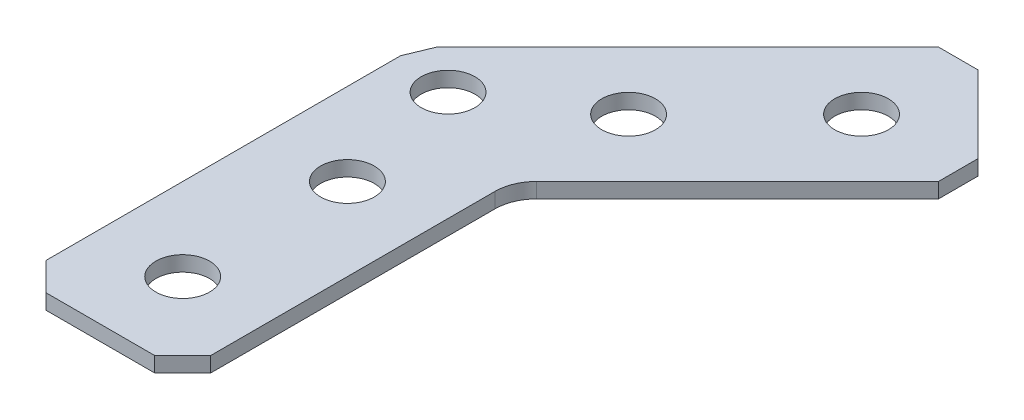
ISO-10303-21;
HEADER;
FILE_DESCRIPTION(('STEP AP214'),'2;1');
FILE_NAME('part.step','',(''),(''),'','','');
FILE_SCHEMA(('AUTOMOTIVE_DESIGN { 1 0 10303 214 1 1 1 1 }'));
ENDSEC;
DATA;
#1=APPLICATION_CONTEXT('core data for automotive mechanical design processes');
#2=APPLICATION_PROTOCOL_DEFINITION('international standard','automotive_design',2000,#1);
#3=PRODUCT_CONTEXT('',#1,'mechanical');
#4=PRODUCT('Part','Part','',(#3));
#5=PRODUCT_RELATED_PRODUCT_CATEGORY('part','',(#4));
#6=PRODUCT_DEFINITION_FORMATION('','',#4);
#7=PRODUCT_DEFINITION_CONTEXT('part definition',#1,'design');
#8=PRODUCT_DEFINITION('design','',#6,#7);
#9=PRODUCT_DEFINITION_SHAPE('','',#8);
#10=(LENGTH_UNIT() NAMED_UNIT(*) SI_UNIT(.MILLI.,.METRE.));
#11=(NAMED_UNIT(*) PLANE_ANGLE_UNIT() SI_UNIT($,.RADIAN.));
#12=(NAMED_UNIT(*) SI_UNIT($,.STERADIAN.) SOLID_ANGLE_UNIT());
#13=UNCERTAINTY_MEASURE_WITH_UNIT(LENGTH_MEASURE(1.E-05),#10,'distance_accuracy_value','');
#14=(GEOMETRIC_REPRESENTATION_CONTEXT(3) GLOBAL_UNCERTAINTY_ASSIGNED_CONTEXT((#13)) GLOBAL_UNIT_ASSIGNED_CONTEXT((#10,
#11,#12)) REPRESENTATION_CONTEXT('',''));
#15=CARTESIAN_POINT('',(0.,0.,0.));
#16=DIRECTION('',(0.,0.,1.));
#17=DIRECTION('',(1.,0.,0.));
#18=AXIS2_PLACEMENT_3D('',#15,#16,#17);
#19=CARTESIAN_POINT('',(-6.34999999999996,1.1684,12.7));
#20=DIRECTION('',(0.,-1.,0.));
#21=DIRECTION('',(0.,0.,-1.));
#22=AXIS2_PLACEMENT_3D('',#19,#20,#21);
#23=PLANE('',#22);
#24=CARTESIAN_POINT('',(15.3302561210692,1.1684,-30.6605122421383));
#25=DIRECTION('',(0.,-1.,0.));
#26=DIRECTION('',(0.,0.,-1.));
#27=AXIS2_PLACEMENT_3D('',#24,#25,#26);
#28=CIRCLE('',#27,2.0701);
#29=CARTESIAN_POINT('',(15.3302561210692,1.1684,-32.7306122421383));
#30=VERTEX_POINT('',#29);
#31=EDGE_CURVE('E226',#30,#30,#28,.T.);
#32=ORIENTED_EDGE('',*,*,#31,.T.);
#33=EDGE_LOOP('',(#32));
#34=FACE_BOUND('',#33,.T.);
#35=CARTESIAN_POINT('',(0.,1.1684,-6.35000000000009));
#36=DIRECTION('',(0.,-1.,0.));
#37=DIRECTION('',(0.,0.,-1.));
#38=AXIS2_PLACEMENT_3D('',#35,#36,#37);
#39=CIRCLE('',#38,2.07009999999998);
#40=CARTESIAN_POINT('',(0.,1.1684,-8.42010000000007));
#41=VERTEX_POINT('',#40);
#42=EDGE_CURVE('E229',#41,#41,#39,.T.);
#43=ORIENTED_EDGE('',*,*,#42,.T.);
#44=EDGE_LOOP('',(#43));
#45=FACE_BOUND('',#44,.T.);
#46=CARTESIAN_POINT('',(-2.08546691384424,1.1684,-16.1940848006638));
#47=DIRECTION('',(0.,-1.,0.));
#48=DIRECTION('',(0.,0.,-1.));
#49=AXIS2_PLACEMENT_3D('',#46,#47,#48);
#50=CIRCLE('',#49,2.0701);
#51=CARTESIAN_POINT('',(-2.08546691384424,1.1684,-18.2641848006638));
#52=VERTEX_POINT('',#51);
#53=EDGE_CURVE('E232',#52,#52,#50,.T.);
#54=ORIENTED_EDGE('',*,*,#53,.T.);
#55=EDGE_LOOP('',(#54));
#56=FACE_BOUND('',#55,.T.);
#57=DIRECTION('',(1.,0.,0.));
#58=VECTOR('',#57,1.);
#59=CARTESIAN_POINT('',(13.8036125804875,1.1684,-38.1141248226257));
#60=LINE('',#59,#58);
#61=CARTESIAN_POINT('',(16.856899661651,1.1684,-38.1141248226257));
#62=VERTEX_POINT('',#61);
#63=CARTESIAN_POINT('',(13.8036125804875,1.1684,-38.1141248226257));
#64=VERTEX_POINT('',#63);
#65=EDGE_CURVE('E165',#62,#64,#60,.F.);
#66=ORIENTED_EDGE('',*,*,#65,.T.);
#67=DIRECTION('',(0.707106781186549,0.,-0.707106781186546));
#68=VECTOR('',#67,1.);
#69=CARTESIAN_POINT('',(-5.52378646952377,1.1684,-18.7867257726145));
#70=LINE('',#69,#68);
#71=CARTESIAN_POINT('',(-5.52378646952377,1.1684,-18.7867257726145));
#72=VERTEX_POINT('',#71);
#73=EDGE_CURVE('E166',#64,#72,#70,.F.);
#74=ORIENTED_EDGE('',*,*,#73,.T.);
#75=DIRECTION('',(0.38268343236509,0.,-0.923879532511287));
#76=VECTOR('',#75,1.);
#77=CARTESIAN_POINT('',(-6.35,1.1684,-16.7920698619227));
#78=LINE('',#77,#76);
#79=CARTESIAN_POINT('',(-6.34999999999999,1.1684,-16.7920698619227));
#80=VERTEX_POINT('',#79);
#81=EDGE_CURVE('E177',#72,#80,#78,.F.);
#82=ORIENTED_EDGE('',*,*,#81,.T.);
#83=DIRECTION('',(0.,0.,-1.));
#84=VECTOR('',#83,1.);
#85=CARTESIAN_POINT('',(-6.34999999999999,1.1684,-12.7));
#86=LINE('',#85,#84);
#87=CARTESIAN_POINT('',(-6.34999999999998,1.1684,10.541));
#88=VERTEX_POINT('',#87);
#89=EDGE_CURVE('E426',#80,#88,#86,.F.);
#90=ORIENTED_EDGE('',*,*,#89,.T.);
#91=DIRECTION('',(-0.707106781186546,0.,-0.707106781186549));
#92=VECTOR('',#91,1.);
#93=CARTESIAN_POINT('',(-4.191,1.1684,12.7));
#94=LINE('',#93,#92);
#95=CARTESIAN_POINT('',(-4.191,1.1684,12.7));
#96=VERTEX_POINT('',#95);
#97=EDGE_CURVE('E428',#88,#96,#94,.F.);
#98=ORIENTED_EDGE('',*,*,#97,.T.);
#99=DIRECTION('',(-1.,0.,0.));
#100=VECTOR('',#99,1.);
#101=CARTESIAN_POINT('',(-6.34999999999999,1.1684,12.7));
#102=LINE('',#101,#100);
#103=CARTESIAN_POINT('',(4.19099999999999,1.1684,12.7));
#104=VERTEX_POINT('',#103);
#105=EDGE_CURVE('E433',#96,#104,#102,.F.);
#106=ORIENTED_EDGE('',*,*,#105,.T.);
#107=DIRECTION('',(-0.707106781186549,0.,0.707106781186546));
#108=VECTOR('',#107,1.);
#109=CARTESIAN_POINT('',(6.35,1.1684,10.541));
#110=LINE('',#109,#108);
#111=CARTESIAN_POINT('',(6.35,1.1684,10.541));
#112=VERTEX_POINT('',#111);
#113=EDGE_CURVE('E199',#104,#112,#110,.F.);
#114=ORIENTED_EDGE('',*,*,#113,.T.);
#115=DIRECTION('',(0.,0.,1.));
#116=VECTOR('',#115,1.);
#117=CARTESIAN_POINT('',(6.35,1.1684,-12.7));
#118=LINE('',#117,#116);
#119=CARTESIAN_POINT('',(6.35,1.1684,-11.3848719394654));
#120=VERTEX_POINT('',#119);
#121=EDGE_CURVE('E121',#112,#120,#118,.F.);
#122=ORIENTED_EDGE('',*,*,#121,.T.);
#123=CARTESIAN_POINT('',(9.525,1.1684,-11.3848719394654));
#124=DIRECTION('',(0.,1.,0.));
#125=DIRECTION('',(0.,0.,1.));
#126=AXIS2_PLACEMENT_3D('',#123,#124,#125);
#127=CIRCLE('',#126,3.175);
#128=CARTESIAN_POINT('',(7.27993596973271,1.1684,-13.6299359697327));
#129=VERTEX_POINT('',#128);
#130=EDGE_CURVE('E102',#120,#129,#127,.F.);
#131=ORIENTED_EDGE('',*,*,#130,.T.);
#132=DIRECTION('',(-0.707106781186549,0.,0.707106781186546));
#133=VECTOR('',#132,1.);
#134=CARTESIAN_POINT('',(24.3105122421383,1.1684,-30.6605122421383));
#135=LINE('',#134,#133);
#136=CARTESIAN_POINT('',(22.7838687015566,1.1684,-29.1338687015565));
#137=VERTEX_POINT('',#136);
#138=EDGE_CURVE('E107',#129,#137,#135,.F.);
#139=ORIENTED_EDGE('',*,*,#138,.T.);
#140=DIRECTION('',(0.,0.,1.));
#141=VECTOR('',#140,1.);
#142=CARTESIAN_POINT('',(22.7838687015566,1.1684,-32.18715578272));
#143=LINE('',#142,#141);
#144=CARTESIAN_POINT('',(22.7838687015566,1.1684,-32.18715578272));
#145=VERTEX_POINT('',#144);
#146=EDGE_CURVE('E116',#137,#145,#143,.F.);
#147=ORIENTED_EDGE('',*,*,#146,.T.);
#148=DIRECTION('',(0.707106781186546,0.,0.707106781186549));
#149=VECTOR('',#148,1.);
#150=CARTESIAN_POINT('',(15.3302561210692,1.1684,-39.6407683632074));
#151=LINE('',#150,#149);
#152=EDGE_CURVE('E155',#145,#62,#151,.F.);
#153=ORIENTED_EDGE('',*,*,#152,.T.);
#154=EDGE_LOOP('',(#66,#74,#82,#90,#98,#106,#114,#122,#131,#139,#147,#153));
#155=FACE_BOUND('',#154,.T.);
#156=CARTESIAN_POINT('',(0.,1.1684,6.35));
#157=DIRECTION('',(0.,-1.,0.));
#158=DIRECTION('',(0.,0.,-1.));
#159=AXIS2_PLACEMENT_3D('',#156,#157,#158);
#160=CIRCLE('',#159,2.0701);
#161=CARTESIAN_POINT('',(0.,1.1684,4.2799));
#162=VERTEX_POINT('',#161);
#163=EDGE_CURVE('E189',#162,#162,#160,.T.);
#164=ORIENTED_EDGE('',*,*,#163,.T.);
#165=EDGE_LOOP('',(#164));
#166=FACE_BOUND('',#165,.T.);
#167=CARTESIAN_POINT('',(6.34999999999998,1.1684,-21.6802561210692));
#168=DIRECTION('',(0.,-1.,0.));
#169=DIRECTION('',(0.,0.,-1.));
#170=AXIS2_PLACEMENT_3D('',#167,#168,#169);
#171=CIRCLE('',#170,2.0701);
#172=CARTESIAN_POINT('',(6.34999999999998,1.1684,-23.7503561210692));
#173=VERTEX_POINT('',#172);
#174=EDGE_CURVE('E18',#173,#173,#171,.T.);
#175=ORIENTED_EDGE('',*,*,#174,.T.);
#176=EDGE_LOOP('',(#175));
#177=FACE_BOUND('',#176,.T.);
#178=ADVANCED_FACE('F15',(#34,#45,#56,#155,#166,#177),#23,.F.);
#179=CARTESIAN_POINT('',(6.34999999999998,1.1684,-21.6802561210692));
#180=DIRECTION('',(0.,-1.,0.));
#181=DIRECTION('',(0.,0.,-1.));
#182=AXIS2_PLACEMENT_3D('',#179,#180,#181);
#183=CYLINDRICAL_SURFACE('',#182,2.0701);
#184=ORIENTED_EDGE('',*,*,#174,.F.);
#185=EDGE_LOOP('',(#184));
#186=FACE_BOUND('',#185,.T.);
#187=CARTESIAN_POINT('',(6.34999999999998,0.,-21.6802561210692));
#188=DIRECTION('',(0.,-1.,0.));
#189=DIRECTION('',(0.,0.,-1.));
#190=AXIS2_PLACEMENT_3D('',#187,#188,#189);
#191=CIRCLE('',#190,2.0701);
#192=CARTESIAN_POINT('',(6.34999999999998,0.,-23.7503561210692));
#193=VERTEX_POINT('',#192);
#194=EDGE_CURVE('E223',#193,#193,#191,.F.);
#195=ORIENTED_EDGE('',*,*,#194,.F.);
#196=EDGE_LOOP('',(#195));
#197=FACE_BOUND('',#196,.T.);
#198=ADVANCED_FACE('F240',(#186,#197),#183,.F.);
#199=CARTESIAN_POINT('',(0.,1.1684,6.35));
#200=DIRECTION('',(0.,-1.,0.));
#201=DIRECTION('',(0.,0.,-1.));
#202=AXIS2_PLACEMENT_3D('',#199,#200,#201);
#203=CYLINDRICAL_SURFACE('',#202,2.0701);
#204=ORIENTED_EDGE('',*,*,#163,.F.);
#205=EDGE_LOOP('',(#204));
#206=FACE_BOUND('',#205,.T.);
#207=CARTESIAN_POINT('',(0.,0.,6.35));
#208=DIRECTION('',(0.,-1.,0.));
#209=DIRECTION('',(0.,0.,-1.));
#210=AXIS2_PLACEMENT_3D('',#207,#208,#209);
#211=CIRCLE('',#210,2.0701);
#212=CARTESIAN_POINT('',(0.,0.,4.2799));
#213=VERTEX_POINT('',#212);
#214=EDGE_CURVE('E171',#213,#213,#211,.F.);
#215=ORIENTED_EDGE('',*,*,#214,.F.);
#216=EDGE_LOOP('',(#215));
#217=FACE_BOUND('',#216,.T.);
#218=ADVANCED_FACE('F243',(#206,#217),#203,.F.);
#219=CARTESIAN_POINT('',(-5.52378646952377,1.1684,-18.7867257726145));
#220=DIRECTION('',(0.707106781186546,0.,0.707106781186549));
#221=DIRECTION('',(0.707106781186549,0.,-0.707106781186546));
#222=AXIS2_PLACEMENT_3D('',#219,#220,#221);
#223=PLANE('',#222);
#224=DIRECTION('',(0.,1.,0.));
#225=VECTOR('',#224,1.);
#226=CARTESIAN_POINT('',(13.8036125804874,1.1684,-38.1141248226257));
#227=LINE('',#226,#225);
#228=CARTESIAN_POINT('',(13.8036125804875,0.,-38.1141248226257));
#229=VERTEX_POINT('',#228);
#230=EDGE_CURVE('E163',#64,#229,#227,.F.);
#231=ORIENTED_EDGE('',*,*,#230,.T.);
#232=DIRECTION('',(0.707106781186549,0.,-0.707106781186546));
#233=VECTOR('',#232,1.);
#234=CARTESIAN_POINT('',(-5.52378646952377,0.,-18.7867257726145));
#235=LINE('',#234,#233);
#236=CARTESIAN_POINT('',(-5.52378646952377,0.,-18.7867257726145));
#237=VERTEX_POINT('',#236);
#238=EDGE_CURVE('E160',#237,#229,#235,.T.);
#239=ORIENTED_EDGE('',*,*,#238,.F.);
#240=DIRECTION('',(0.,1.,0.));
#241=VECTOR('',#240,1.);
#242=CARTESIAN_POINT('',(-5.52378646952377,1.1684,-18.7867257726145));
#243=LINE('',#242,#241);
#244=EDGE_CURVE('E174',#237,#72,#243,.T.);
#245=ORIENTED_EDGE('',*,*,#244,.T.);
#246=ORIENTED_EDGE('',*,*,#73,.F.);
#247=EDGE_LOOP('',(#231,#239,#245,#246));
#248=FACE_BOUND('',#247,.T.);
#249=ADVANCED_FACE('F305',(#248),#223,.F.);
#250=CARTESIAN_POINT('',(13.8036125804875,1.1684,-38.1141248226257));
#251=DIRECTION('',(0.,0.,1.));
#252=DIRECTION('',(1.,0.,0.));
#253=AXIS2_PLACEMENT_3D('',#250,#251,#252);
#254=PLANE('',#253);
#255=DIRECTION('',(0.,1.,0.));
#256=VECTOR('',#255,1.);
#257=CARTESIAN_POINT('',(16.856899661651,1.1684,-38.1141248226257));
#258=LINE('',#257,#256);
#259=CARTESIAN_POINT('',(16.8568996616509,0.,-38.1141248226257));
#260=VERTEX_POINT('',#259);
#261=EDGE_CURVE('E146',#62,#260,#258,.F.);
#262=ORIENTED_EDGE('',*,*,#261,.T.);
#263=DIRECTION('',(1.,0.,0.));
#264=VECTOR('',#263,1.);
#265=CARTESIAN_POINT('',(-6.34999999999996,0.,-38.1141248226257));
#266=LINE('',#265,#264);
#267=EDGE_CURVE('E151',#229,#260,#266,.T.);
#268=ORIENTED_EDGE('',*,*,#267,.F.);
#269=ORIENTED_EDGE('',*,*,#230,.F.);
#270=ORIENTED_EDGE('',*,*,#65,.F.);
#271=EDGE_LOOP('',(#262,#268,#269,#270));
#272=FACE_BOUND('',#271,.T.);
#273=ADVANCED_FACE('F301',(#272),#254,.F.);
#274=CARTESIAN_POINT('',(15.3302561210692,1.1684,-39.6407683632074));
#275=DIRECTION('',(-0.707106781186549,0.,0.707106781186546));
#276=DIRECTION('',(0.707106781186546,0.,0.707106781186549));
#277=AXIS2_PLACEMENT_3D('',#274,#275,#276);
#278=PLANE('',#277);
#279=ORIENTED_EDGE('',*,*,#261,.F.);
#280=ORIENTED_EDGE('',*,*,#152,.F.);
#281=DIRECTION('',(0.,1.,0.));
#282=VECTOR('',#281,1.);
#283=CARTESIAN_POINT('',(22.7838687015566,1.1684,-32.18715578272));
#284=LINE('',#283,#282);
#285=CARTESIAN_POINT('',(22.7838687015566,0.,-32.18715578272));
#286=VERTEX_POINT('',#285);
#287=EDGE_CURVE('E144',#145,#286,#284,.F.);
#288=ORIENTED_EDGE('',*,*,#287,.T.);
#289=DIRECTION('',(0.707106781186546,0.,0.707106781186549));
#290=VECTOR('',#289,1.);
#291=CARTESIAN_POINT('',(16.856899661651,0.,-38.1141248226257));
#292=LINE('',#291,#290);
#293=EDGE_CURVE('E141',#260,#286,#292,.T.);
#294=ORIENTED_EDGE('',*,*,#293,.F.);
#295=EDGE_LOOP('',(#279,#280,#288,#294));
#296=FACE_BOUND('',#295,.T.);
#297=ADVANCED_FACE('F297',(#296),#278,.F.);
#298=CARTESIAN_POINT('',(22.7838687015566,1.1684,-32.18715578272));
#299=DIRECTION('',(-1.,0.,0.));
#300=DIRECTION('',(0.,0.,1.));
#301=AXIS2_PLACEMENT_3D('',#298,#299,#300);
#302=PLANE('',#301);
#303=DIRECTION('',(0.,1.,0.));
#304=VECTOR('',#303,1.);
#305=CARTESIAN_POINT('',(22.7838687015566,1.1684,-29.1338687015565));
#306=LINE('',#305,#304);
#307=CARTESIAN_POINT('',(22.7838687015566,0.,-29.1338687015565));
#308=VERTEX_POINT('',#307);
#309=EDGE_CURVE('E112',#137,#308,#306,.F.);
#310=ORIENTED_EDGE('',*,*,#309,.T.);
#311=DIRECTION('',(0.,0.,-1.));
#312=VECTOR('',#311,1.);
#313=CARTESIAN_POINT('',(22.7838687015566,0.,12.7));
#314=LINE('',#313,#312);
#315=EDGE_CURVE('E137',#286,#308,#314,.F.);
#316=ORIENTED_EDGE('',*,*,#315,.F.);
#317=ORIENTED_EDGE('',*,*,#287,.F.);
#318=ORIENTED_EDGE('',*,*,#146,.F.);
#319=EDGE_LOOP('',(#310,#316,#317,#318));
#320=FACE_BOUND('',#319,.T.);
#321=ADVANCED_FACE('F294',(#320),#302,.F.);
#322=CARTESIAN_POINT('',(24.3105122421383,1.1684,-30.6605122421383));
#323=DIRECTION('',(-0.707106781186546,0.,-0.707106781186549));
#324=DIRECTION('',(-0.707106781186549,0.,0.707106781186546));
#325=AXIS2_PLACEMENT_3D('',#322,#323,#324);
#326=PLANE('',#325);
#327=ORIENTED_EDGE('',*,*,#309,.F.);
#328=ORIENTED_EDGE('',*,*,#138,.F.);
#329=DIRECTION('',(0.,1.,0.));
#330=VECTOR('',#329,1.);
#331=CARTESIAN_POINT('',(7.27993596973271,1.1684,-13.6299359697327));
#332=LINE('',#331,#330);
#333=CARTESIAN_POINT('',(7.27993596973271,0.,-13.6299359697327));
#334=VERTEX_POINT('',#333);
#335=EDGE_CURVE('E110',#129,#334,#332,.F.);
#336=ORIENTED_EDGE('',*,*,#335,.T.);
#337=DIRECTION('',(-0.707106781186549,0.,0.707106781186546));
#338=VECTOR('',#337,1.);
#339=CARTESIAN_POINT('',(22.7838687015566,0.,-29.1338687015565));
#340=LINE('',#339,#338);
#341=EDGE_CURVE('E140',#308,#334,#340,.T.);
#342=ORIENTED_EDGE('',*,*,#341,.F.);
#343=EDGE_LOOP('',(#327,#328,#336,#342));
#344=FACE_BOUND('',#343,.T.);
#345=ADVANCED_FACE('F108',(#344),#326,.F.);
#346=CARTESIAN_POINT('',(9.525,1.1684,-11.3848719394654));
#347=DIRECTION('',(0.,1.,0.));
#348=DIRECTION('',(0.,0.,1.));
#349=AXIS2_PLACEMENT_3D('',#346,#347,#348);
#350=CYLINDRICAL_SURFACE('',#349,3.175);
#351=DIRECTION('',(0.,1.,0.));
#352=VECTOR('',#351,1.);
#353=CARTESIAN_POINT('',(6.35,1.1684,-11.3848719394654));
#354=LINE('',#353,#352);
#355=CARTESIAN_POINT('',(6.35,0.,-11.3848719394654));
#356=VERTEX_POINT('',#355);
#357=EDGE_CURVE('E123',#120,#356,#354,.F.);
#358=ORIENTED_EDGE('',*,*,#357,.T.);
#359=CARTESIAN_POINT('',(9.525,0.,-11.3848719394654));
#360=DIRECTION('',(0.,1.,0.));
#361=DIRECTION('',(0.,0.,1.));
#362=AXIS2_PLACEMENT_3D('',#359,#360,#361);
#363=CIRCLE('',#362,3.175);
#364=EDGE_CURVE('E127',#334,#356,#363,.T.);
#365=ORIENTED_EDGE('',*,*,#364,.F.);
#366=ORIENTED_EDGE('',*,*,#335,.F.);
#367=ORIENTED_EDGE('',*,*,#130,.F.);
#368=EDGE_LOOP('',(#358,#365,#366,#367));
#369=FACE_BOUND('',#368,.T.);
#370=ADVANCED_FACE('F125',(#369),#350,.F.);
#371=CARTESIAN_POINT('',(6.35,1.1684,-12.7));
#372=DIRECTION('',(-1.,0.,0.));
#373=DIRECTION('',(0.,0.,1.));
#374=AXIS2_PLACEMENT_3D('',#371,#372,#373);
#375=PLANE('',#374);
#376=DIRECTION('',(0.,1.,0.));
#377=VECTOR('',#376,1.);
#378=CARTESIAN_POINT('',(6.35,1.1684,10.541));
#379=LINE('',#378,#377);
#380=CARTESIAN_POINT('',(6.35,0.,10.541));
#381=VERTEX_POINT('',#380);
#382=EDGE_CURVE('E196',#112,#381,#379,.F.);
#383=ORIENTED_EDGE('',*,*,#382,.T.);
#384=DIRECTION('',(0.,0.,-1.));
#385=VECTOR('',#384,1.);
#386=CARTESIAN_POINT('',(6.35,0.,12.7));
#387=LINE('',#386,#385);
#388=EDGE_CURVE('E220',#356,#381,#387,.F.);
#389=ORIENTED_EDGE('',*,*,#388,.F.);
#390=ORIENTED_EDGE('',*,*,#357,.F.);
#391=ORIENTED_EDGE('',*,*,#121,.F.);
#392=EDGE_LOOP('',(#383,#389,#390,#391));
#393=FACE_BOUND('',#392,.T.);
#394=ADVANCED_FACE('F285',(#393),#375,.F.);
#395=CARTESIAN_POINT('',(6.35,1.1684,10.541));
#396=DIRECTION('',(-0.707106781186546,0.,-0.707106781186549));
#397=DIRECTION('',(-0.707106781186549,0.,0.707106781186546));
#398=AXIS2_PLACEMENT_3D('',#395,#396,#397);
#399=PLANE('',#398);
#400=DIRECTION('',(0.,1.,0.));
#401=VECTOR('',#400,1.);
#402=CARTESIAN_POINT('',(4.19099999999999,1.1684,12.7));
#403=LINE('',#402,#401);
#404=CARTESIAN_POINT('',(4.19099999999999,0.,12.7));
#405=VERTEX_POINT('',#404);
#406=EDGE_CURVE('E201',#104,#405,#403,.F.);
#407=ORIENTED_EDGE('',*,*,#406,.T.);
#408=DIRECTION('',(-0.70710678118655,0.,0.707106781186546));
#409=VECTOR('',#408,1.);
#410=CARTESIAN_POINT('',(6.35,0.,10.541));
#411=LINE('',#410,#409);
#412=EDGE_CURVE('E416',#381,#405,#411,.T.);
#413=ORIENTED_EDGE('',*,*,#412,.F.);
#414=ORIENTED_EDGE('',*,*,#382,.F.);
#415=ORIENTED_EDGE('',*,*,#113,.F.);
#416=EDGE_LOOP('',(#407,#413,#414,#415));
#417=FACE_BOUND('',#416,.T.);
#418=ADVANCED_FACE('F281',(#417),#399,.F.);
#419=CARTESIAN_POINT('',(-6.34999999999999,1.1684,12.7));
#420=DIRECTION('',(0.,0.,-1.));
#421=DIRECTION('',(-1.,0.,0.));
#422=AXIS2_PLACEMENT_3D('',#419,#420,#421);
#423=PLANE('',#422);
#424=DIRECTION('',(0.,1.,0.));
#425=VECTOR('',#424,1.);
#426=CARTESIAN_POINT('',(-4.191,1.1684,12.7));
#427=LINE('',#426,#425);
#428=CARTESIAN_POINT('',(-4.191,0.,12.7));
#429=VERTEX_POINT('',#428);
#430=EDGE_CURVE('E431',#96,#429,#427,.F.);
#431=ORIENTED_EDGE('',*,*,#430,.T.);
#432=DIRECTION('',(1.,0.,0.));
#433=VECTOR('',#432,1.);
#434=CARTESIAN_POINT('',(-6.34999999999996,0.,12.7));
#435=LINE('',#434,#433);
#436=EDGE_CURVE('E412',#405,#429,#435,.F.);
#437=ORIENTED_EDGE('',*,*,#436,.F.);
#438=ORIENTED_EDGE('',*,*,#406,.F.);
#439=ORIENTED_EDGE('',*,*,#105,.F.);
#440=EDGE_LOOP('',(#431,#437,#438,#439));
#441=FACE_BOUND('',#440,.T.);
#442=ADVANCED_FACE('F277',(#441),#423,.F.);
#443=CARTESIAN_POINT('',(-4.191,1.1684,12.7));
#444=DIRECTION('',(0.707106781186549,0.,-0.707106781186546));
#445=DIRECTION('',(-0.707106781186546,0.,-0.707106781186549));
#446=AXIS2_PLACEMENT_3D('',#443,#444,#445);
#447=PLANE('',#446);
#448=DIRECTION('',(0.,1.,0.));
#449=VECTOR('',#448,1.);
#450=CARTESIAN_POINT('',(-6.34999999999999,1.1684,10.541));
#451=LINE('',#450,#449);
#452=CARTESIAN_POINT('',(-6.34999999999999,0.,10.541));
#453=VERTEX_POINT('',#452);
#454=EDGE_CURVE('E178',#88,#453,#451,.F.);
#455=ORIENTED_EDGE('',*,*,#454,.T.);
#456=DIRECTION('',(-0.707106781186546,0.,-0.707106781186549));
#457=VECTOR('',#456,1.);
#458=CARTESIAN_POINT('',(-4.191,0.,12.7));
#459=LINE('',#458,#457);
#460=EDGE_CURVE('E409',#429,#453,#459,.T.);
#461=ORIENTED_EDGE('',*,*,#460,.F.);
#462=ORIENTED_EDGE('',*,*,#430,.F.);
#463=ORIENTED_EDGE('',*,*,#97,.F.);
#464=EDGE_LOOP('',(#455,#461,#462,#463));
#465=FACE_BOUND('',#464,.T.);
#466=ADVANCED_FACE('F274',(#465),#447,.F.);
#467=CARTESIAN_POINT('',(-6.34999999999999,1.1684,-12.7));
#468=DIRECTION('',(1.,0.,0.));
#469=DIRECTION('',(0.,0.,-1.));
#470=AXIS2_PLACEMENT_3D('',#467,#468,#469);
#471=PLANE('',#470);
#472=ORIENTED_EDGE('',*,*,#454,.F.);
#473=ORIENTED_EDGE('',*,*,#89,.F.);
#474=DIRECTION('',(0.,1.,0.));
#475=VECTOR('',#474,1.);
#476=CARTESIAN_POINT('',(-6.35,1.1684,-16.7920698619227));
#477=LINE('',#476,#475);
#478=CARTESIAN_POINT('',(-6.35,0.,-16.7920698619227));
#479=VERTEX_POINT('',#478);
#480=EDGE_CURVE('E33',#80,#479,#477,.F.);
#481=ORIENTED_EDGE('',*,*,#480,.T.);
#482=DIRECTION('',(0.,0.,-1.));
#483=VECTOR('',#482,1.);
#484=CARTESIAN_POINT('',(-6.34999999999999,0.,12.7));
#485=LINE('',#484,#483);
#486=EDGE_CURVE('E185',#453,#479,#485,.T.);
#487=ORIENTED_EDGE('',*,*,#486,.F.);
#488=EDGE_LOOP('',(#472,#473,#481,#487));
#489=FACE_BOUND('',#488,.T.);
#490=ADVANCED_FACE('F270',(#489),#471,.F.);
#491=CARTESIAN_POINT('',(-6.35,1.1684,-16.7920698619227));
#492=DIRECTION('',(0.923879532511287,0.,0.38268343236509));
#493=DIRECTION('',(0.38268343236509,0.,-0.923879532511287));
#494=AXIS2_PLACEMENT_3D('',#491,#492,#493);
#495=PLANE('',#494);
#496=ORIENTED_EDGE('',*,*,#480,.F.);
#497=ORIENTED_EDGE('',*,*,#81,.F.);
#498=ORIENTED_EDGE('',*,*,#244,.F.);
#499=DIRECTION('',(0.38268343236509,0.,-0.923879532511287));
#500=VECTOR('',#499,1.);
#501=CARTESIAN_POINT('',(-6.35,0.,-16.7920698619227));
#502=LINE('',#501,#500);
#503=EDGE_CURVE('E181',#479,#237,#502,.T.);
#504=ORIENTED_EDGE('',*,*,#503,.F.);
#505=EDGE_LOOP('',(#496,#497,#498,#504));
#506=FACE_BOUND('',#505,.T.);
#507=ADVANCED_FACE('F266',(#506),#495,.F.);
#508=CARTESIAN_POINT('',(-2.08546691384424,1.1684,-16.1940848006638));
#509=DIRECTION('',(0.,-1.,0.));
#510=DIRECTION('',(0.,0.,-1.));
#511=AXIS2_PLACEMENT_3D('',#508,#509,#510);
#512=CYLINDRICAL_SURFACE('',#511,2.0701);
#513=ORIENTED_EDGE('',*,*,#53,.F.);
#514=EDGE_LOOP('',(#513));
#515=FACE_BOUND('',#514,.T.);
#516=CARTESIAN_POINT('',(-2.08546691384424,0.,-16.1940848006638));
#517=DIRECTION('',(0.,-1.,0.));
#518=DIRECTION('',(0.,0.,-1.));
#519=AXIS2_PLACEMENT_3D('',#516,#517,#518);
#520=CIRCLE('',#519,2.0701);
#521=CARTESIAN_POINT('',(-2.08546691384424,0.,-18.2641848006638));
#522=VERTEX_POINT('',#521);
#523=EDGE_CURVE('E184',#522,#522,#520,.F.);
#524=ORIENTED_EDGE('',*,*,#523,.F.);
#525=EDGE_LOOP('',(#524));
#526=FACE_BOUND('',#525,.T.);
#527=ADVANCED_FACE('F262',(#515,#526),#512,.F.);
#528=CARTESIAN_POINT('',(0.,1.1684,-6.35000000000009));
#529=DIRECTION('',(0.,-1.,0.));
#530=DIRECTION('',(0.,0.,-1.));
#531=AXIS2_PLACEMENT_3D('',#528,#529,#530);
#532=CYLINDRICAL_SURFACE('',#531,2.07009999999998);
#533=ORIENTED_EDGE('',*,*,#42,.F.);
#534=EDGE_LOOP('',(#533));
#535=FACE_BOUND('',#534,.T.);
#536=CARTESIAN_POINT('',(0.,0.,-6.35000000000009));
#537=DIRECTION('',(0.,-1.,0.));
#538=DIRECTION('',(0.,0.,-1.));
#539=AXIS2_PLACEMENT_3D('',#536,#537,#538);
#540=CIRCLE('',#539,2.07009999999998);
#541=CARTESIAN_POINT('',(0.,0.,-8.42010000000007));
#542=VERTEX_POINT('',#541);
#543=EDGE_CURVE('E24',#542,#542,#540,.F.);
#544=ORIENTED_EDGE('',*,*,#543,.F.);
#545=EDGE_LOOP('',(#544));
#546=FACE_BOUND('',#545,.T.);
#547=ADVANCED_FACE('F255',(#535,#546),#532,.F.);
#548=CARTESIAN_POINT('',(15.3302561210692,1.1684,-30.6605122421383));
#549=DIRECTION('',(0.,-1.,0.));
#550=DIRECTION('',(0.,0.,-1.));
#551=AXIS2_PLACEMENT_3D('',#548,#549,#550);
#552=CYLINDRICAL_SURFACE('',#551,2.0701);
#553=ORIENTED_EDGE('',*,*,#31,.F.);
#554=EDGE_LOOP('',(#553));
#555=FACE_BOUND('',#554,.T.);
#556=CARTESIAN_POINT('',(15.3302561210692,0.,-30.6605122421383));
#557=DIRECTION('',(0.,-1.,0.));
#558=DIRECTION('',(0.,0.,-1.));
#559=AXIS2_PLACEMENT_3D('',#556,#557,#558);
#560=CIRCLE('',#559,2.0701);
#561=CARTESIAN_POINT('',(15.3302561210692,0.,-32.7306122421383));
#562=VERTEX_POINT('',#561);
#563=EDGE_CURVE('E9',#562,#562,#560,.F.);
#564=ORIENTED_EDGE('',*,*,#563,.F.);
#565=EDGE_LOOP('',(#564));
#566=FACE_BOUND('',#565,.T.);
#567=ADVANCED_FACE('F248',(#555,#566),#552,.F.);
#568=CARTESIAN_POINT('',(-6.34999999999996,0.,12.7));
#569=DIRECTION('',(0.,-1.,0.));
#570=DIRECTION('',(0.,0.,-1.));
#571=AXIS2_PLACEMENT_3D('',#568,#569,#570);
#572=PLANE('',#571);
#573=ORIENTED_EDGE('',*,*,#563,.T.);
#574=EDGE_LOOP('',(#573));
#575=FACE_BOUND('',#574,.T.);
#576=ORIENTED_EDGE('',*,*,#543,.T.);
#577=EDGE_LOOP('',(#576));
#578=FACE_BOUND('',#577,.T.);
#579=ORIENTED_EDGE('',*,*,#523,.T.);
#580=EDGE_LOOP('',(#579));
#581=FACE_BOUND('',#580,.T.);
#582=ORIENTED_EDGE('',*,*,#486,.T.);
#583=ORIENTED_EDGE('',*,*,#503,.T.);
#584=ORIENTED_EDGE('',*,*,#238,.T.);
#585=ORIENTED_EDGE('',*,*,#267,.T.);
#586=ORIENTED_EDGE('',*,*,#293,.T.);
#587=ORIENTED_EDGE('',*,*,#315,.T.);
#588=ORIENTED_EDGE('',*,*,#341,.T.);
#589=ORIENTED_EDGE('',*,*,#364,.T.);
#590=ORIENTED_EDGE('',*,*,#388,.T.);
#591=ORIENTED_EDGE('',*,*,#412,.T.);
#592=ORIENTED_EDGE('',*,*,#436,.T.);
#593=ORIENTED_EDGE('',*,*,#460,.T.);
#594=EDGE_LOOP('',(#582,#583,#584,#585,#586,#587,#588,#589,#590,#591,#592,#593));
#595=FACE_BOUND('',#594,.T.);
#596=ORIENTED_EDGE('',*,*,#214,.T.);
#597=EDGE_LOOP('',(#596));
#598=FACE_BOUND('',#597,.T.);
#599=ORIENTED_EDGE('',*,*,#194,.T.);
#600=EDGE_LOOP('',(#599));
#601=FACE_BOUND('',#600,.T.);
#602=ADVANCED_FACE('F246',(#575,#578,#581,#595,#598,#601),#572,.T.);
#603=CLOSED_SHELL('',(#178,#198,#218,#249,#273,#297,#321,#345,#370,#394,#418,#442,#466,#490,
#507,#527,#547,#567,#602));
#604=MANIFOLD_SOLID_BREP('B1',#603);
#605=ADVANCED_BREP_SHAPE_REPRESENTATION('',(#18,#604),#14);
#606=SHAPE_DEFINITION_REPRESENTATION(#9,#605);
ENDSEC;
END-ISO-10303-21;
